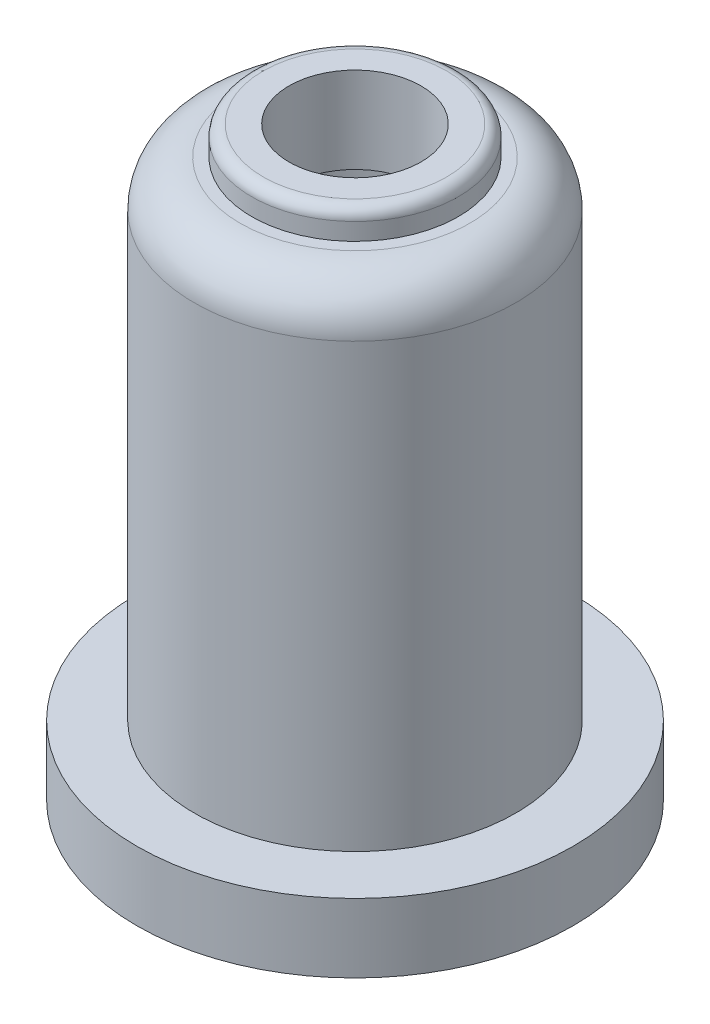
ISO-10303-21;
HEADER;
FILE_DESCRIPTION(('STEP AP214'),'2;1');
FILE_NAME('part.step','',(''),(''),'','','');
FILE_SCHEMA(('AUTOMOTIVE_DESIGN { 1 0 10303 214 1 1 1 1 }'));
ENDSEC;
DATA;
#1=APPLICATION_CONTEXT('core data for automotive mechanical design processes');
#2=APPLICATION_PROTOCOL_DEFINITION('international standard','automotive_design',2000,#1);
#3=PRODUCT_CONTEXT('',#1,'mechanical');
#4=PRODUCT('Part','Part','',(#3));
#5=PRODUCT_RELATED_PRODUCT_CATEGORY('part','',(#4));
#6=PRODUCT_DEFINITION_FORMATION('','',#4);
#7=PRODUCT_DEFINITION_CONTEXT('part definition',#1,'design');
#8=PRODUCT_DEFINITION('design','',#6,#7);
#9=PRODUCT_DEFINITION_SHAPE('','',#8);
#10=(LENGTH_UNIT() NAMED_UNIT(*) SI_UNIT(.MILLI.,.METRE.));
#11=(NAMED_UNIT(*) PLANE_ANGLE_UNIT() SI_UNIT($,.RADIAN.));
#12=(NAMED_UNIT(*) SI_UNIT($,.STERADIAN.) SOLID_ANGLE_UNIT());
#13=UNCERTAINTY_MEASURE_WITH_UNIT(LENGTH_MEASURE(1.E-05),#10,'distance_accuracy_value','');
#14=(GEOMETRIC_REPRESENTATION_CONTEXT(3) GLOBAL_UNCERTAINTY_ASSIGNED_CONTEXT((#13)) GLOBAL_UNIT_ASSIGNED_CONTEXT((#10,
#11,#12)) REPRESENTATION_CONTEXT('',''));
#15=CARTESIAN_POINT('',(0.,0.,0.));
#16=DIRECTION('',(0.,0.,1.));
#17=DIRECTION('',(1.,0.,0.));
#18=AXIS2_PLACEMENT_3D('',#15,#16,#17);
#19=CARTESIAN_POINT('',(38.,0.,0.));
#20=DIRECTION('',(0.,-1.,0.));
#21=DIRECTION('',(0.,0.,-1.));
#22=AXIS2_PLACEMENT_3D('',#19,#20,#21);
#23=PLANE('',#22);
#24=CARTESIAN_POINT('',(0.,0.,0.));
#25=DIRECTION('',(0.,-1.,0.));
#26=DIRECTION('',(0.,0.,-1.));
#27=AXIS2_PLACEMENT_3D('',#24,#25,#26);
#28=CIRCLE('',#27,38.);
#29=CARTESIAN_POINT('',(0.,0.,-38.));
#30=VERTEX_POINT('',#29);
#31=EDGE_CURVE('E10',#30,#30,#28,.T.);
#32=ORIENTED_EDGE('',*,*,#31,.T.);
#33=EDGE_LOOP('',(#32));
#34=FACE_BOUND('',#33,.T.);
#35=CARTESIAN_POINT('',(0.,0.,0.));
#36=DIRECTION('',(0.,-1.,0.));
#37=DIRECTION('',(0.,0.,-1.));
#38=AXIS2_PLACEMENT_3D('',#35,#36,#37);
#39=CIRCLE('',#38,35.);
#40=CARTESIAN_POINT('',(0.,0.,-35.));
#41=VERTEX_POINT('',#40);
#42=EDGE_CURVE('E128',#41,#41,#39,.T.);
#43=ORIENTED_EDGE('',*,*,#42,.F.);
#44=EDGE_LOOP('',(#43));
#45=FACE_BOUND('',#44,.T.);
#46=ADVANCED_FACE('F41',(#34,#45),#23,.T.);
#47=CARTESIAN_POINT('',(0.,0.,0.));
#48=DIRECTION('',(0.,-1.,0.));
#49=DIRECTION('',(0.,0.,-1.));
#50=AXIS2_PLACEMENT_3D('',#47,#48,#49);
#51=CYLINDRICAL_SURFACE('',#50,38.);
#52=CARTESIAN_POINT('',(0.,12.,0.));
#53=DIRECTION('',(0.,-1.,0.));
#54=DIRECTION('',(0.,0.,-1.));
#55=AXIS2_PLACEMENT_3D('',#52,#53,#54);
#56=CIRCLE('',#55,38.);
#57=CARTESIAN_POINT('',(0.,12.,-38.));
#58=VERTEX_POINT('',#57);
#59=EDGE_CURVE('E48',#58,#58,#56,.T.);
#60=ORIENTED_EDGE('',*,*,#59,.T.);
#61=EDGE_LOOP('',(#60));
#62=FACE_BOUND('',#61,.T.);
#63=ORIENTED_EDGE('',*,*,#31,.F.);
#64=EDGE_LOOP('',(#63));
#65=FACE_BOUND('',#64,.T.);
#66=ADVANCED_FACE('F137',(#62,#65),#51,.T.);
#67=CARTESIAN_POINT('',(38.,12.,0.));
#68=DIRECTION('',(0.,1.,0.));
#69=DIRECTION('',(0.,0.,1.));
#70=AXIS2_PLACEMENT_3D('',#67,#68,#69);
#71=PLANE('',#70);
#72=CARTESIAN_POINT('',(0.,12.,0.));
#73=DIRECTION('',(0.,-1.,0.));
#74=DIRECTION('',(0.,0.,-1.));
#75=AXIS2_PLACEMENT_3D('',#72,#73,#74);
#76=CIRCLE('',#75,28.);
#77=CARTESIAN_POINT('',(0.,12.,-28.));
#78=VERTEX_POINT('',#77);
#79=EDGE_CURVE('E53',#78,#78,#76,.T.);
#80=ORIENTED_EDGE('',*,*,#79,.T.);
#81=EDGE_LOOP('',(#80));
#82=FACE_BOUND('',#81,.T.);
#83=ORIENTED_EDGE('',*,*,#59,.F.);
#84=EDGE_LOOP('',(#83));
#85=FACE_BOUND('',#84,.T.);
#86=ADVANCED_FACE('F141',(#82,#85),#71,.T.);
#87=CARTESIAN_POINT('',(0.,0.,0.));
#88=DIRECTION('',(0.,-1.,0.));
#89=DIRECTION('',(0.,0.,-1.));
#90=AXIS2_PLACEMENT_3D('',#87,#88,#89);
#91=CYLINDRICAL_SURFACE('',#90,28.);
#92=CARTESIAN_POINT('',(0.,88.9999999999999,0.));
#93=DIRECTION('',(0.,-1.,0.));
#94=DIRECTION('',(0.,0.,-1.));
#95=AXIS2_PLACEMENT_3D('',#92,#93,#94);
#96=CIRCLE('',#95,28.);
#97=CARTESIAN_POINT('',(0.,88.9999999999999,-28.));
#98=VERTEX_POINT('',#97);
#99=EDGE_CURVE('E58',#98,#98,#96,.T.);
#100=ORIENTED_EDGE('',*,*,#99,.T.);
#101=EDGE_LOOP('',(#100));
#102=FACE_BOUND('',#101,.T.);
#103=ORIENTED_EDGE('',*,*,#79,.F.);
#104=EDGE_LOOP('',(#103));
#105=FACE_BOUND('',#104,.T.);
#106=ADVANCED_FACE('F145',(#102,#105),#91,.T.);
#107=CARTESIAN_POINT('',(0.,89.,0.));
#108=DIRECTION('',(0.,-1.,0.));
#109=DIRECTION('',(0.,0.,-1.));
#110=AXIS2_PLACEMENT_3D('',#107,#108,#109);
#111=TOROIDAL_SURFACE('',#110,20.,8.);
#112=CARTESIAN_POINT('',(0.,97.,0.));
#113=DIRECTION('',(0.,-1.,0.));
#114=DIRECTION('',(0.,0.,-1.));
#115=AXIS2_PLACEMENT_3D('',#112,#113,#114);
#116=CIRCLE('',#115,19.9999999999999);
#117=CARTESIAN_POINT('',(0.,97.,-19.9999999999999));
#118=VERTEX_POINT('',#117);
#119=EDGE_CURVE('E64',#118,#118,#116,.T.);
#120=ORIENTED_EDGE('',*,*,#119,.T.);
#121=EDGE_LOOP('',(#120));
#122=FACE_BOUND('',#121,.T.);
#123=ORIENTED_EDGE('',*,*,#99,.F.);
#124=EDGE_LOOP('',(#123));
#125=FACE_BOUND('',#124,.T.);
#126=ADVANCED_FACE('F152',(#122,#125),#111,.T.);
#127=CARTESIAN_POINT('',(19.9999999999999,97.,0.));
#128=DIRECTION('',(0.,1.,0.));
#129=DIRECTION('',(0.,0.,1.));
#130=AXIS2_PLACEMENT_3D('',#127,#128,#129);
#131=PLANE('',#130);
#132=CARTESIAN_POINT('',(0.,97.,0.));
#133=DIRECTION('',(0.,-1.,0.));
#134=DIRECTION('',(0.,0.,-1.));
#135=AXIS2_PLACEMENT_3D('',#132,#133,#134);
#136=CIRCLE('',#135,18.);
#137=CARTESIAN_POINT('',(0.,97.,-18.));
#138=VERTEX_POINT('',#137);
#139=EDGE_CURVE('E68',#138,#138,#136,.T.);
#140=ORIENTED_EDGE('',*,*,#139,.T.);
#141=EDGE_LOOP('',(#140));
#142=FACE_BOUND('',#141,.T.);
#143=ORIENTED_EDGE('',*,*,#119,.F.);
#144=EDGE_LOOP('',(#143));
#145=FACE_BOUND('',#144,.T.);
#146=ADVANCED_FACE('F156',(#142,#145),#131,.T.);
#147=CARTESIAN_POINT('',(0.,0.,0.));
#148=DIRECTION('',(0.,-1.,0.));
#149=DIRECTION('',(0.,0.,-1.));
#150=AXIS2_PLACEMENT_3D('',#147,#148,#149);
#151=CYLINDRICAL_SURFACE('',#150,18.);
#152=CARTESIAN_POINT('',(0.,100.,0.));
#153=DIRECTION('',(0.,-1.,0.));
#154=DIRECTION('',(0.,0.,-1.));
#155=AXIS2_PLACEMENT_3D('',#152,#153,#154);
#156=CIRCLE('',#155,18.);
#157=CARTESIAN_POINT('',(0.,100.,-18.));
#158=VERTEX_POINT('',#157);
#159=EDGE_CURVE('E72',#158,#158,#156,.T.);
#160=ORIENTED_EDGE('',*,*,#159,.T.);
#161=EDGE_LOOP('',(#160));
#162=FACE_BOUND('',#161,.T.);
#163=ORIENTED_EDGE('',*,*,#139,.F.);
#164=EDGE_LOOP('',(#163));
#165=FACE_BOUND('',#164,.T.);
#166=ADVANCED_FACE('F160',(#162,#165),#151,.T.);
#167=CARTESIAN_POINT('',(0.,100.,0.));
#168=DIRECTION('',(0.,-1.,0.));
#169=DIRECTION('',(0.,0.,-1.));
#170=AXIS2_PLACEMENT_3D('',#167,#168,#169);
#171=TOROIDAL_SURFACE('',#170,16.,2.);
#172=CARTESIAN_POINT('',(0.,102.,0.));
#173=DIRECTION('',(0.,-1.,0.));
#174=DIRECTION('',(0.,0.,-1.));
#175=AXIS2_PLACEMENT_3D('',#172,#173,#174);
#176=CIRCLE('',#175,16.);
#177=CARTESIAN_POINT('',(0.,102.,-16.));
#178=VERTEX_POINT('',#177);
#179=EDGE_CURVE('E76',#178,#178,#176,.T.);
#180=ORIENTED_EDGE('',*,*,#179,.T.);
#181=EDGE_LOOP('',(#180));
#182=FACE_BOUND('',#181,.T.);
#183=ORIENTED_EDGE('',*,*,#159,.F.);
#184=EDGE_LOOP('',(#183));
#185=FACE_BOUND('',#184,.T.);
#186=ADVANCED_FACE('F164',(#182,#185),#171,.T.);
#187=CARTESIAN_POINT('',(16.,102.,0.));
#188=DIRECTION('',(0.,1.,0.));
#189=DIRECTION('',(0.,0.,1.));
#190=AXIS2_PLACEMENT_3D('',#187,#188,#189);
#191=PLANE('',#190);
#192=CARTESIAN_POINT('',(0.,102.,0.));
#193=DIRECTION('',(0.,-1.,0.));
#194=DIRECTION('',(0.,0.,-1.));
#195=AXIS2_PLACEMENT_3D('',#192,#193,#194);
#196=CIRCLE('',#195,11.5);
#197=CARTESIAN_POINT('',(0.,102.,-11.5));
#198=VERTEX_POINT('',#197);
#199=EDGE_CURVE('E80',#198,#198,#196,.T.);
#200=ORIENTED_EDGE('',*,*,#199,.T.);
#201=EDGE_LOOP('',(#200));
#202=FACE_BOUND('',#201,.T.);
#203=ORIENTED_EDGE('',*,*,#179,.F.);
#204=EDGE_LOOP('',(#203));
#205=FACE_BOUND('',#204,.T.);
#206=ADVANCED_FACE('F168',(#202,#205),#191,.T.);
#207=CARTESIAN_POINT('',(0.,0.,0.));
#208=DIRECTION('',(0.,-1.,0.));
#209=DIRECTION('',(0.,0.,-1.));
#210=AXIS2_PLACEMENT_3D('',#207,#208,#209);
#211=CYLINDRICAL_SURFACE('',#210,11.5);
#212=CARTESIAN_POINT('',(0.,87.,0.));
#213=DIRECTION('',(0.,-1.,0.));
#214=DIRECTION('',(0.,0.,-1.));
#215=AXIS2_PLACEMENT_3D('',#212,#213,#214);
#216=CIRCLE('',#215,11.5);
#217=CARTESIAN_POINT('',(0.,87.,-11.5));
#218=VERTEX_POINT('',#217);
#219=EDGE_CURVE('E84',#218,#218,#216,.T.);
#220=ORIENTED_EDGE('',*,*,#219,.T.);
#221=EDGE_LOOP('',(#220));
#222=FACE_BOUND('',#221,.T.);
#223=ORIENTED_EDGE('',*,*,#199,.F.);
#224=EDGE_LOOP('',(#223));
#225=FACE_BOUND('',#224,.T.);
#226=ADVANCED_FACE('F172',(#222,#225),#211,.F.);
#227=CARTESIAN_POINT('',(11.5,87.,0.));
#228=DIRECTION('',(0.,-1.,0.));
#229=DIRECTION('',(0.,0.,-1.));
#230=AXIS2_PLACEMENT_3D('',#227,#228,#229);
#231=PLANE('',#230);
#232=CARTESIAN_POINT('',(0.,87.,0.));
#233=DIRECTION('',(0.,-1.,0.));
#234=DIRECTION('',(0.,0.,-1.));
#235=AXIS2_PLACEMENT_3D('',#232,#233,#234);
#236=CIRCLE('',#235,20.);
#237=CARTESIAN_POINT('',(0.,87.,-20.));
#238=VERTEX_POINT('',#237);
#239=EDGE_CURVE('E88',#238,#238,#236,.T.);
#240=ORIENTED_EDGE('',*,*,#239,.T.);
#241=EDGE_LOOP('',(#240));
#242=FACE_BOUND('',#241,.T.);
#243=ORIENTED_EDGE('',*,*,#219,.F.);
#244=EDGE_LOOP('',(#243));
#245=FACE_BOUND('',#244,.T.);
#246=ADVANCED_FACE('F176',(#242,#245),#231,.T.);
#247=CARTESIAN_POINT('',(0.,85.,0.));
#248=DIRECTION('',(0.,-1.,0.));
#249=DIRECTION('',(0.,0.,-1.));
#250=AXIS2_PLACEMENT_3D('',#247,#248,#249);
#251=TOROIDAL_SURFACE('',#250,20.,2.);
#252=CARTESIAN_POINT('',(0.,85.,0.));
#253=DIRECTION('',(0.,-1.,0.));
#254=DIRECTION('',(0.,0.,-1.));
#255=AXIS2_PLACEMENT_3D('',#252,#253,#254);
#256=CIRCLE('',#255,22.);
#257=CARTESIAN_POINT('',(0.,85.,-22.));
#258=VERTEX_POINT('',#257);
#259=EDGE_CURVE('E92',#258,#258,#256,.T.);
#260=ORIENTED_EDGE('',*,*,#259,.T.);
#261=EDGE_LOOP('',(#260));
#262=FACE_BOUND('',#261,.T.);
#263=ORIENTED_EDGE('',*,*,#239,.F.);
#264=EDGE_LOOP('',(#263));
#265=FACE_BOUND('',#264,.T.);
#266=ADVANCED_FACE('F180',(#262,#265),#251,.F.);
#267=CARTESIAN_POINT('',(0.,0.,0.));
#268=DIRECTION('',(0.,-1.,0.));
#269=DIRECTION('',(0.,0.,-1.));
#270=AXIS2_PLACEMENT_3D('',#267,#268,#269);
#271=CYLINDRICAL_SURFACE('',#270,22.);
#272=CARTESIAN_POINT('',(0.,43.,0.));
#273=DIRECTION('',(0.,-1.,0.));
#274=DIRECTION('',(0.,0.,-1.));
#275=AXIS2_PLACEMENT_3D('',#272,#273,#274);
#276=CIRCLE('',#275,22.);
#277=CARTESIAN_POINT('',(0.,43.,-22.));
#278=VERTEX_POINT('',#277);
#279=EDGE_CURVE('E96',#278,#278,#276,.T.);
#280=ORIENTED_EDGE('',*,*,#279,.T.);
#281=EDGE_LOOP('',(#280));
#282=FACE_BOUND('',#281,.T.);
#283=ORIENTED_EDGE('',*,*,#259,.F.);
#284=EDGE_LOOP('',(#283));
#285=FACE_BOUND('',#284,.T.);
#286=ADVANCED_FACE('F184',(#282,#285),#271,.F.);
#287=CARTESIAN_POINT('',(0.,43.,0.));
#288=DIRECTION('',(0.,-1.,0.));
#289=DIRECTION('',(0.,0.,-1.));
#290=AXIS2_PLACEMENT_3D('',#287,#288,#289);
#291=TOROIDAL_SURFACE('',#290,20.,2.);
#292=CARTESIAN_POINT('',(0.,41.,0.));
#293=DIRECTION('',(0.,-1.,0.));
#294=DIRECTION('',(0.,0.,-1.));
#295=AXIS2_PLACEMENT_3D('',#292,#293,#294);
#296=CIRCLE('',#295,20.);
#297=CARTESIAN_POINT('',(0.,41.,-20.));
#298=VERTEX_POINT('',#297);
#299=EDGE_CURVE('E100',#298,#298,#296,.T.);
#300=ORIENTED_EDGE('',*,*,#299,.T.);
#301=EDGE_LOOP('',(#300));
#302=FACE_BOUND('',#301,.T.);
#303=ORIENTED_EDGE('',*,*,#279,.F.);
#304=EDGE_LOOP('',(#303));
#305=FACE_BOUND('',#304,.T.);
#306=ADVANCED_FACE('F188',(#302,#305),#291,.F.);
#307=CARTESIAN_POINT('',(6.,41.,0.));
#308=DIRECTION('',(0.,1.,0.));
#309=DIRECTION('',(0.,0.,1.));
#310=AXIS2_PLACEMENT_3D('',#307,#308,#309);
#311=PLANE('',#310);
#312=CARTESIAN_POINT('',(0.,41.,0.));
#313=DIRECTION('',(0.,-1.,0.));
#314=DIRECTION('',(0.,0.,-1.));
#315=AXIS2_PLACEMENT_3D('',#312,#313,#314);
#316=CIRCLE('',#315,6.);
#317=CARTESIAN_POINT('',(0.,41.,-6.));
#318=VERTEX_POINT('',#317);
#319=EDGE_CURVE('E104',#318,#318,#316,.T.);
#320=ORIENTED_EDGE('',*,*,#319,.T.);
#321=EDGE_LOOP('',(#320));
#322=FACE_BOUND('',#321,.T.);
#323=ORIENTED_EDGE('',*,*,#299,.F.);
#324=EDGE_LOOP('',(#323));
#325=FACE_BOUND('',#324,.T.);
#326=ADVANCED_FACE('F192',(#322,#325),#311,.T.);
#327=CARTESIAN_POINT('',(0.,0.,0.));
#328=DIRECTION('',(0.,-1.,0.));
#329=DIRECTION('',(0.,0.,-1.));
#330=AXIS2_PLACEMENT_3D('',#327,#328,#329);
#331=CYLINDRICAL_SURFACE('',#330,6.);
#332=CARTESIAN_POINT('',(0.,31.,0.));
#333=DIRECTION('',(0.,-1.,0.));
#334=DIRECTION('',(0.,0.,-1.));
#335=AXIS2_PLACEMENT_3D('',#332,#333,#334);
#336=CIRCLE('',#335,6.);
#337=CARTESIAN_POINT('',(0.,31.,-6.));
#338=VERTEX_POINT('',#337);
#339=EDGE_CURVE('E108',#338,#338,#336,.T.);
#340=ORIENTED_EDGE('',*,*,#339,.T.);
#341=EDGE_LOOP('',(#340));
#342=FACE_BOUND('',#341,.T.);
#343=ORIENTED_EDGE('',*,*,#319,.F.);
#344=EDGE_LOOP('',(#343));
#345=FACE_BOUND('',#344,.T.);
#346=ADVANCED_FACE('F196',(#342,#345),#331,.F.);
#347=CARTESIAN_POINT('',(20.,31.,0.));
#348=DIRECTION('',(0.,-1.,0.));
#349=DIRECTION('',(0.,0.,-1.));
#350=AXIS2_PLACEMENT_3D('',#347,#348,#349);
#351=PLANE('',#350);
#352=CARTESIAN_POINT('',(0.,31.,0.));
#353=DIRECTION('',(0.,-1.,0.));
#354=DIRECTION('',(0.,0.,-1.));
#355=AXIS2_PLACEMENT_3D('',#352,#353,#354);
#356=CIRCLE('',#355,20.);
#357=CARTESIAN_POINT('',(0.,31.,-20.));
#358=VERTEX_POINT('',#357);
#359=EDGE_CURVE('E112',#358,#358,#356,.T.);
#360=ORIENTED_EDGE('',*,*,#359,.T.);
#361=EDGE_LOOP('',(#360));
#362=FACE_BOUND('',#361,.T.);
#363=ORIENTED_EDGE('',*,*,#339,.F.);
#364=EDGE_LOOP('',(#363));
#365=FACE_BOUND('',#364,.T.);
#366=ADVANCED_FACE('F200',(#362,#365),#351,.T.);
#367=CARTESIAN_POINT('',(0.,29.,0.));
#368=DIRECTION('',(0.,-1.,0.));
#369=DIRECTION('',(0.,0.,-1.));
#370=AXIS2_PLACEMENT_3D('',#367,#368,#369);
#371=TOROIDAL_SURFACE('',#370,20.,2.);
#372=CARTESIAN_POINT('',(0.,29.,0.));
#373=DIRECTION('',(0.,-1.,0.));
#374=DIRECTION('',(0.,0.,-1.));
#375=AXIS2_PLACEMENT_3D('',#372,#373,#374);
#376=CIRCLE('',#375,22.);
#377=CARTESIAN_POINT('',(0.,29.,-22.));
#378=VERTEX_POINT('',#377);
#379=EDGE_CURVE('E116',#378,#378,#376,.T.);
#380=ORIENTED_EDGE('',*,*,#379,.T.);
#381=EDGE_LOOP('',(#380));
#382=FACE_BOUND('',#381,.T.);
#383=ORIENTED_EDGE('',*,*,#359,.F.);
#384=EDGE_LOOP('',(#383));
#385=FACE_BOUND('',#384,.T.);
#386=ADVANCED_FACE('F204',(#382,#385),#371,.F.);
#387=CARTESIAN_POINT('',(0.,0.,0.));
#388=DIRECTION('',(0.,-1.,0.));
#389=DIRECTION('',(0.,0.,-1.));
#390=AXIS2_PLACEMENT_3D('',#387,#388,#389);
#391=CYLINDRICAL_SURFACE('',#390,22.);
#392=CARTESIAN_POINT('',(0.,3.,0.));
#393=DIRECTION('',(0.,-1.,0.));
#394=DIRECTION('',(0.,0.,-1.));
#395=AXIS2_PLACEMENT_3D('',#392,#393,#394);
#396=CIRCLE('',#395,22.);
#397=CARTESIAN_POINT('',(0.,3.,-22.));
#398=VERTEX_POINT('',#397);
#399=EDGE_CURVE('E120',#398,#398,#396,.T.);
#400=ORIENTED_EDGE('',*,*,#399,.T.);
#401=EDGE_LOOP('',(#400));
#402=FACE_BOUND('',#401,.T.);
#403=ORIENTED_EDGE('',*,*,#379,.F.);
#404=EDGE_LOOP('',(#403));
#405=FACE_BOUND('',#404,.T.);
#406=ADVANCED_FACE('F208',(#402,#405),#391,.F.);
#407=CARTESIAN_POINT('',(35.,3.,0.));
#408=DIRECTION('',(0.,-1.,0.));
#409=DIRECTION('',(0.,0.,-1.));
#410=AXIS2_PLACEMENT_3D('',#407,#408,#409);
#411=PLANE('',#410);
#412=CARTESIAN_POINT('',(0.,3.,0.));
#413=DIRECTION('',(0.,-1.,0.));
#414=DIRECTION('',(0.,0.,-1.));
#415=AXIS2_PLACEMENT_3D('',#412,#413,#414);
#416=CIRCLE('',#415,35.);
#417=CARTESIAN_POINT('',(0.,3.,-35.));
#418=VERTEX_POINT('',#417);
#419=EDGE_CURVE('E124',#418,#418,#416,.T.);
#420=ORIENTED_EDGE('',*,*,#419,.T.);
#421=EDGE_LOOP('',(#420));
#422=FACE_BOUND('',#421,.T.);
#423=ORIENTED_EDGE('',*,*,#399,.F.);
#424=EDGE_LOOP('',(#423));
#425=FACE_BOUND('',#424,.T.);
#426=ADVANCED_FACE('F212',(#422,#425),#411,.T.);
#427=CARTESIAN_POINT('',(0.,0.,0.));
#428=DIRECTION('',(0.,-1.,0.));
#429=DIRECTION('',(0.,0.,-1.));
#430=AXIS2_PLACEMENT_3D('',#427,#428,#429);
#431=CYLINDRICAL_SURFACE('',#430,35.);
#432=ORIENTED_EDGE('',*,*,#42,.T.);
#433=EDGE_LOOP('',(#432));
#434=FACE_BOUND('',#433,.T.);
#435=ORIENTED_EDGE('',*,*,#419,.F.);
#436=EDGE_LOOP('',(#435));
#437=FACE_BOUND('',#436,.T.);
#438=ADVANCED_FACE('F133',(#434,#437),#431,.F.);
#439=CLOSED_SHELL('',(#46,#66,#86,#106,#126,#146,#166,#186,#206,#226,#246,#266,#286,#306,#326,
#346,#366,#386,#406,#426,#438));
#440=MANIFOLD_SOLID_BREP('B2',#439);
#441=ADVANCED_BREP_SHAPE_REPRESENTATION('',(#18,#440),#14);
#442=SHAPE_DEFINITION_REPRESENTATION(#9,#441);
ENDSEC;
END-ISO-10303-21;
